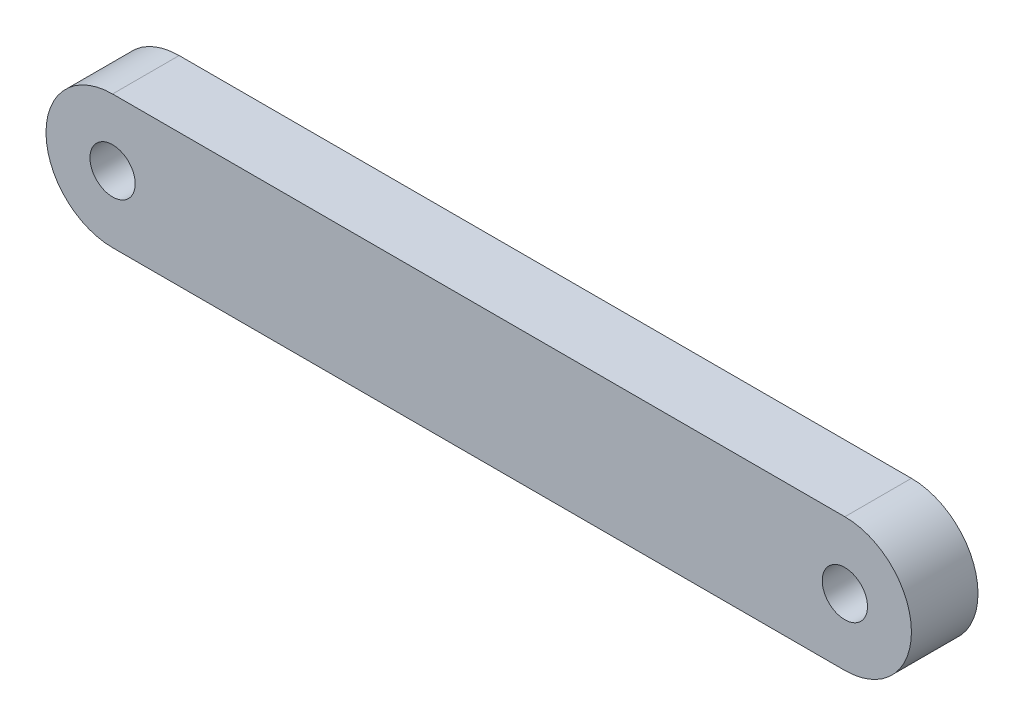
ISO-10303-21;
HEADER;
FILE_DESCRIPTION(('STEP AP214'),'2;1');
FILE_NAME('part.step','',(''),(''),'','','');
FILE_SCHEMA(('AUTOMOTIVE_DESIGN { 1 0 10303 214 1 1 1 1 }'));
ENDSEC;
DATA;
#1=APPLICATION_CONTEXT('core data for automotive mechanical design processes');
#2=APPLICATION_PROTOCOL_DEFINITION('international standard','automotive_design',2000,#1);
#3=PRODUCT_CONTEXT('',#1,'mechanical');
#4=PRODUCT('Part','Part','',(#3));
#5=PRODUCT_RELATED_PRODUCT_CATEGORY('part','',(#4));
#6=PRODUCT_DEFINITION_FORMATION('','',#4);
#7=PRODUCT_DEFINITION_CONTEXT('part definition',#1,'design');
#8=PRODUCT_DEFINITION('design','',#6,#7);
#9=PRODUCT_DEFINITION_SHAPE('','',#8);
#10=(LENGTH_UNIT() NAMED_UNIT(*) SI_UNIT(.MILLI.,.METRE.));
#11=(NAMED_UNIT(*) PLANE_ANGLE_UNIT() SI_UNIT($,.RADIAN.));
#12=(NAMED_UNIT(*) SI_UNIT($,.STERADIAN.) SOLID_ANGLE_UNIT());
#13=UNCERTAINTY_MEASURE_WITH_UNIT(LENGTH_MEASURE(1.E-05),#10,'distance_accuracy_value','');
#14=(GEOMETRIC_REPRESENTATION_CONTEXT(3) GLOBAL_UNCERTAINTY_ASSIGNED_CONTEXT((#13)) GLOBAL_UNIT_ASSIGNED_CONTEXT((#10,
#11,#12)) REPRESENTATION_CONTEXT('',''));
#15=CARTESIAN_POINT('',(0.,0.,0.));
#16=DIRECTION('',(0.,0.,1.));
#17=DIRECTION('',(1.,0.,0.));
#18=AXIS2_PLACEMENT_3D('',#15,#16,#17);
#19=CARTESIAN_POINT('',(0.,0.,6.35));
#20=DIRECTION('',(0.,0.,1.));
#21=DIRECTION('',(1.,0.,0.));
#22=AXIS2_PLACEMENT_3D('',#19,#20,#21);
#23=PLANE('',#22);
#24=CARTESIAN_POINT('',(0.,0.,6.35));
#25=DIRECTION('',(0.,0.,1.));
#26=DIRECTION('',(1.,0.,0.));
#27=AXIS2_PLACEMENT_3D('',#24,#25,#26);
#28=CIRCLE('',#27,2.159);
#29=CARTESIAN_POINT('',(2.159,0.,6.35));
#30=VERTEX_POINT('',#29);
#31=EDGE_CURVE('E104',#30,#30,#28,.T.);
#32=ORIENTED_EDGE('',*,*,#31,.F.);
#33=EDGE_LOOP('',(#32));
#34=FACE_BOUND('',#33,.T.);
#35=CARTESIAN_POINT('',(0.,0.,6.35));
#36=DIRECTION('',(0.,0.,1.));
#37=DIRECTION('',(1.,0.,0.));
#38=AXIS2_PLACEMENT_3D('',#35,#36,#37);
#39=CIRCLE('',#38,6.35);
#40=CARTESIAN_POINT('',(0.,6.35,6.35));
#41=VERTEX_POINT('',#40);
#42=CARTESIAN_POINT('',(0.,-6.35,6.35));
#43=VERTEX_POINT('',#42);
#44=EDGE_CURVE('E89',#41,#43,#39,.T.);
#45=ORIENTED_EDGE('',*,*,#44,.T.);
#46=DIRECTION('',(1.,0.,0.));
#47=VECTOR('',#46,1.);
#48=CARTESIAN_POINT('',(0.,-6.35,6.35));
#49=LINE('',#48,#47);
#50=CARTESIAN_POINT('',(69.85,-6.35,6.35));
#51=VERTEX_POINT('',#50);
#52=EDGE_CURVE('E84',#43,#51,#49,.T.);
#53=ORIENTED_EDGE('',*,*,#52,.T.);
#54=CARTESIAN_POINT('',(69.85,0.,6.35));
#55=DIRECTION('',(0.,0.,1.));
#56=DIRECTION('',(1.,0.,0.));
#57=AXIS2_PLACEMENT_3D('',#54,#55,#56);
#58=CIRCLE('',#57,6.35);
#59=CARTESIAN_POINT('',(69.85,6.35,6.35));
#60=VERTEX_POINT('',#59);
#61=EDGE_CURVE('E87',#51,#60,#58,.T.);
#62=ORIENTED_EDGE('',*,*,#61,.T.);
#63=DIRECTION('',(-1.,0.,0.));
#64=VECTOR('',#63,1.);
#65=CARTESIAN_POINT('',(0.,6.35,6.35));
#66=LINE('',#65,#64);
#67=EDGE_CURVE('E54',#60,#41,#66,.T.);
#68=ORIENTED_EDGE('',*,*,#67,.T.);
#69=EDGE_LOOP('',(#45,#53,#62,#68));
#70=FACE_BOUND('',#69,.T.);
#71=CARTESIAN_POINT('',(69.85,0.,6.35));
#72=DIRECTION('',(0.,0.,1.));
#73=DIRECTION('',(1.,0.,0.));
#74=AXIS2_PLACEMENT_3D('',#71,#72,#73);
#75=CIRCLE('',#74,2.15900000000001);
#76=CARTESIAN_POINT('',(72.009,0.,6.35));
#77=VERTEX_POINT('',#76);
#78=EDGE_CURVE('E119',#77,#77,#75,.T.);
#79=ORIENTED_EDGE('',*,*,#78,.F.);
#80=EDGE_LOOP('',(#79));
#81=FACE_BOUND('',#80,.T.);
#82=ADVANCED_FACE('F37',(#34,#70,#81),#23,.T.);
#83=CARTESIAN_POINT('',(0.,0.,0.));
#84=DIRECTION('',(0.,0.,1.));
#85=DIRECTION('',(1.,0.,0.));
#86=AXIS2_PLACEMENT_3D('',#83,#84,#85);
#87=PLANE('',#86);
#88=CARTESIAN_POINT('',(0.,0.,0.));
#89=DIRECTION('',(0.,0.,1.));
#90=DIRECTION('',(1.,0.,0.));
#91=AXIS2_PLACEMENT_3D('',#88,#89,#90);
#92=CIRCLE('',#91,6.35);
#93=CARTESIAN_POINT('',(0.,6.35,0.));
#94=VERTEX_POINT('',#93);
#95=CARTESIAN_POINT('',(0.,-6.35,0.));
#96=VERTEX_POINT('',#95);
#97=EDGE_CURVE('E101',#94,#96,#92,.T.);
#98=ORIENTED_EDGE('',*,*,#97,.F.);
#99=DIRECTION('',(-1.,0.,0.));
#100=VECTOR('',#99,1.);
#101=CARTESIAN_POINT('',(0.,6.35,0.));
#102=LINE('',#101,#100);
#103=CARTESIAN_POINT('',(69.85,6.35,0.));
#104=VERTEX_POINT('',#103);
#105=EDGE_CURVE('E77',#104,#94,#102,.T.);
#106=ORIENTED_EDGE('',*,*,#105,.F.);
#107=CARTESIAN_POINT('',(69.85,0.,0.));
#108=DIRECTION('',(0.,0.,1.));
#109=DIRECTION('',(1.,0.,0.));
#110=AXIS2_PLACEMENT_3D('',#107,#108,#109);
#111=CIRCLE('',#110,6.35);
#112=CARTESIAN_POINT('',(69.85,-6.35,0.));
#113=VERTEX_POINT('',#112);
#114=EDGE_CURVE('E71',#113,#104,#111,.T.);
#115=ORIENTED_EDGE('',*,*,#114,.F.);
#116=DIRECTION('',(1.,0.,0.));
#117=VECTOR('',#116,1.);
#118=CARTESIAN_POINT('',(0.,-6.35,0.));
#119=LINE('',#118,#117);
#120=EDGE_CURVE('E93',#96,#113,#119,.T.);
#121=ORIENTED_EDGE('',*,*,#120,.F.);
#122=EDGE_LOOP('',(#98,#106,#115,#121));
#123=FACE_BOUND('',#122,.T.);
#124=CARTESIAN_POINT('',(0.,0.,0.));
#125=DIRECTION('',(0.,0.,1.));
#126=DIRECTION('',(1.,0.,0.));
#127=AXIS2_PLACEMENT_3D('',#124,#125,#126);
#128=CIRCLE('',#127,2.159);
#129=CARTESIAN_POINT('',(2.159,0.,0.));
#130=VERTEX_POINT('',#129);
#131=EDGE_CURVE('E116',#130,#130,#128,.T.);
#132=ORIENTED_EDGE('',*,*,#131,.T.);
#133=EDGE_LOOP('',(#132));
#134=FACE_BOUND('',#133,.T.);
#135=CARTESIAN_POINT('',(69.85,0.,0.));
#136=DIRECTION('',(0.,0.,1.));
#137=DIRECTION('',(1.,0.,0.));
#138=AXIS2_PLACEMENT_3D('',#135,#136,#137);
#139=CIRCLE('',#138,2.15900000000001);
#140=CARTESIAN_POINT('',(72.009,0.,0.));
#141=VERTEX_POINT('',#140);
#142=EDGE_CURVE('E122',#141,#141,#139,.T.);
#143=ORIENTED_EDGE('',*,*,#142,.T.);
#144=EDGE_LOOP('',(#143));
#145=FACE_BOUND('',#144,.T.);
#146=ADVANCED_FACE('F112',(#123,#134,#145),#87,.F.);
#147=CARTESIAN_POINT('',(0.,0.,6.35));
#148=DIRECTION('',(0.,0.,-1.));
#149=DIRECTION('',(-1.,0.,0.));
#150=AXIS2_PLACEMENT_3D('',#147,#148,#149);
#151=CYLINDRICAL_SURFACE('',#150,6.35);
#152=ORIENTED_EDGE('',*,*,#97,.T.);
#153=DIRECTION('',(0.,0.,-1.));
#154=VECTOR('',#153,1.);
#155=CARTESIAN_POINT('',(0.,-6.35,6.35));
#156=LINE('',#155,#154);
#157=EDGE_CURVE('E11',#43,#96,#156,.T.);
#158=ORIENTED_EDGE('',*,*,#157,.F.);
#159=ORIENTED_EDGE('',*,*,#44,.F.);
#160=DIRECTION('',(0.,0.,-1.));
#161=VECTOR('',#160,1.);
#162=CARTESIAN_POINT('',(0.,6.35,6.35));
#163=LINE('',#162,#161);
#164=EDGE_CURVE('E97',#41,#94,#163,.T.);
#165=ORIENTED_EDGE('',*,*,#164,.T.);
#166=EDGE_LOOP('',(#152,#158,#159,#165));
#167=FACE_BOUND('',#166,.T.);
#168=ADVANCED_FACE('F39',(#167),#151,.T.);
#169=CARTESIAN_POINT('',(0.,-6.35,6.35));
#170=DIRECTION('',(0.,1.,0.));
#171=DIRECTION('',(0.,0.,1.));
#172=AXIS2_PLACEMENT_3D('',#169,#170,#171);
#173=PLANE('',#172);
#174=ORIENTED_EDGE('',*,*,#120,.T.);
#175=DIRECTION('',(0.,0.,-1.));
#176=VECTOR('',#175,1.);
#177=CARTESIAN_POINT('',(69.85,-6.35,6.35));
#178=LINE('',#177,#176);
#179=EDGE_CURVE('E46',#51,#113,#178,.T.);
#180=ORIENTED_EDGE('',*,*,#179,.F.);
#181=ORIENTED_EDGE('',*,*,#52,.F.);
#182=ORIENTED_EDGE('',*,*,#157,.T.);
#183=EDGE_LOOP('',(#174,#180,#181,#182));
#184=FACE_BOUND('',#183,.T.);
#185=ADVANCED_FACE('F92',(#184),#173,.F.);
#186=CARTESIAN_POINT('',(69.85,0.,6.35));
#187=DIRECTION('',(0.,0.,-1.));
#188=DIRECTION('',(-1.,0.,0.));
#189=AXIS2_PLACEMENT_3D('',#186,#187,#188);
#190=CYLINDRICAL_SURFACE('',#189,6.35);
#191=ORIENTED_EDGE('',*,*,#114,.T.);
#192=DIRECTION('',(0.,0.,-1.));
#193=VECTOR('',#192,1.);
#194=CARTESIAN_POINT('',(69.85,6.35,6.35));
#195=LINE('',#194,#193);
#196=EDGE_CURVE('E94',#60,#104,#195,.T.);
#197=ORIENTED_EDGE('',*,*,#196,.F.);
#198=ORIENTED_EDGE('',*,*,#61,.F.);
#199=ORIENTED_EDGE('',*,*,#179,.T.);
#200=EDGE_LOOP('',(#191,#197,#198,#199));
#201=FACE_BOUND('',#200,.T.);
#202=ADVANCED_FACE('F95',(#201),#190,.T.);
#203=CARTESIAN_POINT('',(0.,6.35,6.35));
#204=DIRECTION('',(0.,-1.,0.));
#205=DIRECTION('',(0.,0.,-1.));
#206=AXIS2_PLACEMENT_3D('',#203,#204,#205);
#207=PLANE('',#206);
#208=ORIENTED_EDGE('',*,*,#105,.T.);
#209=ORIENTED_EDGE('',*,*,#164,.F.);
#210=ORIENTED_EDGE('',*,*,#67,.F.);
#211=ORIENTED_EDGE('',*,*,#196,.T.);
#212=EDGE_LOOP('',(#208,#209,#210,#211));
#213=FACE_BOUND('',#212,.T.);
#214=ADVANCED_FACE('F109',(#213),#207,.F.);
#215=CARTESIAN_POINT('',(0.,0.,6.35));
#216=DIRECTION('',(0.,0.,-1.));
#217=DIRECTION('',(-1.,0.,0.));
#218=AXIS2_PLACEMENT_3D('',#215,#216,#217);
#219=CYLINDRICAL_SURFACE('',#218,2.159);
#220=ORIENTED_EDGE('',*,*,#31,.T.);
#221=EDGE_LOOP('',(#220));
#222=FACE_BOUND('',#221,.T.);
#223=ORIENTED_EDGE('',*,*,#131,.F.);
#224=EDGE_LOOP('',(#223));
#225=FACE_BOUND('',#224,.T.);
#226=ADVANCED_FACE('F139',(#222,#225),#219,.F.);
#227=CARTESIAN_POINT('',(69.85,0.,6.35));
#228=DIRECTION('',(0.,0.,-1.));
#229=DIRECTION('',(-1.,0.,0.));
#230=AXIS2_PLACEMENT_3D('',#227,#228,#229);
#231=CYLINDRICAL_SURFACE('',#230,2.15900000000001);
#232=ORIENTED_EDGE('',*,*,#78,.T.);
#233=EDGE_LOOP('',(#232));
#234=FACE_BOUND('',#233,.T.);
#235=ORIENTED_EDGE('',*,*,#142,.F.);
#236=EDGE_LOOP('',(#235));
#237=FACE_BOUND('',#236,.T.);
#238=ADVANCED_FACE('F128',(#234,#237),#231,.F.);
#239=CLOSED_SHELL('',(#82,#146,#168,#185,#202,#214,#226,#238));
#240=MANIFOLD_SOLID_BREP('B2',#239);
#241=ADVANCED_BREP_SHAPE_REPRESENTATION('',(#18,#240),#14);
#242=SHAPE_DEFINITION_REPRESENTATION(#9,#241);
ENDSEC;
END-ISO-10303-21;
